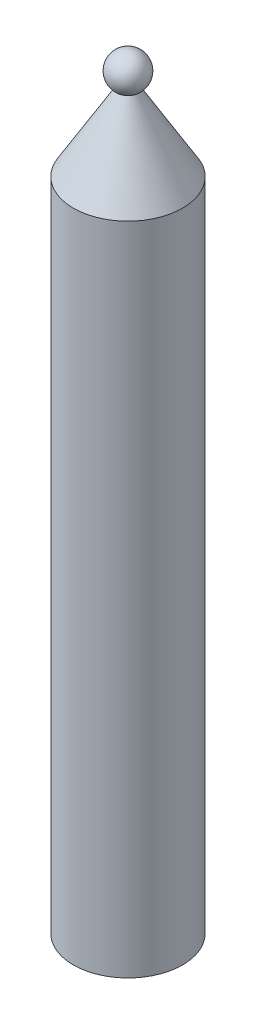
ISO-10303-21;
HEADER;
FILE_DESCRIPTION(('STEP AP214'),'2;1');
FILE_NAME('part.step','',(''),(''),'','','');
FILE_SCHEMA(('AUTOMOTIVE_DESIGN { 1 0 10303 214 1 1 1 1 }'));
ENDSEC;
DATA;
#1=APPLICATION_CONTEXT('core data for automotive mechanical design processes');
#2=APPLICATION_PROTOCOL_DEFINITION('international standard','automotive_design',2000,#1);
#3=PRODUCT_CONTEXT('',#1,'mechanical');
#4=PRODUCT('Part','Part','',(#3));
#5=PRODUCT_RELATED_PRODUCT_CATEGORY('part','',(#4));
#6=PRODUCT_DEFINITION_FORMATION('','',#4);
#7=PRODUCT_DEFINITION_CONTEXT('part definition',#1,'design');
#8=PRODUCT_DEFINITION('design','',#6,#7);
#9=PRODUCT_DEFINITION_SHAPE('','',#8);
#10=(LENGTH_UNIT() NAMED_UNIT(*) SI_UNIT(.MILLI.,.METRE.));
#11=(NAMED_UNIT(*) PLANE_ANGLE_UNIT() SI_UNIT($,.RADIAN.));
#12=(NAMED_UNIT(*) SI_UNIT($,.STERADIAN.) SOLID_ANGLE_UNIT());
#13=UNCERTAINTY_MEASURE_WITH_UNIT(LENGTH_MEASURE(1.E-05),#10,'distance_accuracy_value','');
#14=(GEOMETRIC_REPRESENTATION_CONTEXT(3) GLOBAL_UNCERTAINTY_ASSIGNED_CONTEXT((#13)) GLOBAL_UNIT_ASSIGNED_CONTEXT((#10,
#11,#12)) REPRESENTATION_CONTEXT('',''));
#15=CARTESIAN_POINT('',(0.,0.,0.));
#16=DIRECTION('',(0.,0.,1.));
#17=DIRECTION('',(1.,0.,0.));
#18=AXIS2_PLACEMENT_3D('',#15,#16,#17);
#19=CARTESIAN_POINT('',(0.,0.,0.));
#20=DIRECTION('',(0.,-1.,0.));
#21=DIRECTION('',(0.,0.,-1.));
#22=AXIS2_PLACEMENT_3D('',#19,#20,#21);
#23=PLANE('',#22);
#24=CARTESIAN_POINT('',(0.,0.,0.));
#25=DIRECTION('',(0.,1.,0.));
#26=DIRECTION('',(0.,0.,1.));
#27=AXIS2_PLACEMENT_3D('',#24,#25,#26);
#28=CIRCLE('',#27,5.);
#29=CARTESIAN_POINT('',(0.,0.,5.));
#30=VERTEX_POINT('',#29);
#31=EDGE_CURVE('E62',#30,#30,#28,.T.);
#32=ORIENTED_EDGE('',*,*,#31,.T.);
#33=EDGE_LOOP('',(#32));
#34=FACE_BOUND('',#33,.T.);
#35=CARTESIAN_POINT('',(0.,0.,0.));
#36=DIRECTION('',(0.,1.,0.));
#37=DIRECTION('',(0.,0.,1.));
#38=AXIS2_PLACEMENT_3D('',#35,#36,#37);
#39=CIRCLE('',#38,10.);
#40=CARTESIAN_POINT('',(0.,0.,10.));
#41=VERTEX_POINT('',#40);
#42=EDGE_CURVE('E11',#41,#41,#39,.T.);
#43=ORIENTED_EDGE('',*,*,#42,.F.);
#44=EDGE_LOOP('',(#43));
#45=FACE_BOUND('',#44,.T.);
#46=ADVANCED_FACE('F42',(#34,#45),#23,.T.);
#47=CARTESIAN_POINT('',(0.,140.,0.));
#48=DIRECTION('',(0.,1.,0.));
#49=DIRECTION('',(0.,0.,1.));
#50=AXIS2_PLACEMENT_3D('',#47,#48,#49);
#51=CYLINDRICAL_SURFACE('',#50,10.);
#52=ORIENTED_EDGE('',*,*,#42,.T.);
#53=EDGE_LOOP('',(#52));
#54=FACE_BOUND('',#53,.T.);
#55=CARTESIAN_POINT('',(0.,120.,0.));
#56=DIRECTION('',(0.,1.,0.));
#57=DIRECTION('',(0.,0.,1.));
#58=AXIS2_PLACEMENT_3D('',#55,#56,#57);
#59=CIRCLE('',#58,10.);
#60=CARTESIAN_POINT('',(0.,120.,10.));
#61=VERTEX_POINT('',#60);
#62=EDGE_CURVE('E49',#61,#61,#59,.T.);
#63=ORIENTED_EDGE('',*,*,#62,.F.);
#64=EDGE_LOOP('',(#63));
#65=FACE_BOUND('',#64,.T.);
#66=ADVANCED_FACE('F78',(#54,#65),#51,.T.);
#67=CARTESIAN_POINT('',(0.,134.,0.));
#68=DIRECTION('',(0.,-1.,0.));
#69=DIRECTION('',(0.,0.,-1.));
#70=AXIS2_PLACEMENT_3D('',#67,#68,#69);
#71=CONICAL_SURFACE('',#70,1.6529151545748,0.537635708213951);
#72=ORIENTED_EDGE('',*,*,#62,.T.);
#73=EDGE_LOOP('',(#72));
#74=FACE_BOUND('',#73,.T.);
#75=CARTESIAN_POINT('',(0.,134.,0.));
#76=DIRECTION('',(0.,1.,0.));
#77=DIRECTION('',(0.,0.,1.));
#78=AXIS2_PLACEMENT_3D('',#75,#76,#77);
#79=CIRCLE('',#78,1.6529151545748);
#80=CARTESIAN_POINT('',(0.,134.,1.6529151545748));
#81=VERTEX_POINT('',#80);
#82=EDGE_CURVE('E66',#81,#81,#79,.T.);
#83=ORIENTED_EDGE('',*,*,#82,.F.);
#84=EDGE_LOOP('',(#83));
#85=FACE_BOUND('',#84,.T.);
#86=ADVANCED_FACE('F75',(#74,#85),#71,.T.);
#87=CARTESIAN_POINT('',(0.,136.772322624315,0.));
#88=DIRECTION('',(0.,1.,0.));
#89=DIRECTION('',(-1.,0.,0.));
#90=AXIS2_PLACEMENT_3D('',#87,#88,#89);
#91=SPHERICAL_SURFACE('',#90,3.22767737568526);
#92=ORIENTED_EDGE('',*,*,#82,.T.);
#93=EDGE_LOOP('',(#92));
#94=FACE_BOUND('',#93,.T.);
#95=ADVANCED_FACE('F85',(#94),#91,.T.);
#96=CARTESIAN_POINT('',(0.,120.,0.));
#97=DIRECTION('',(0.,1.,0.));
#98=DIRECTION('',(0.,0.,1.));
#99=AXIS2_PLACEMENT_3D('',#96,#97,#98);
#100=CYLINDRICAL_SURFACE('',#99,5.);
#101=CARTESIAN_POINT('',(0.,110.,0.));
#102=DIRECTION('',(0.,1.,0.));
#103=DIRECTION('',(0.,0.,1.));
#104=AXIS2_PLACEMENT_3D('',#101,#102,#103);
#105=CIRCLE('',#104,5.);
#106=CARTESIAN_POINT('',(0.,110.,5.));
#107=VERTEX_POINT('',#106);
#108=EDGE_CURVE('E59',#107,#107,#105,.T.);
#109=ORIENTED_EDGE('',*,*,#108,.T.);
#110=EDGE_LOOP('',(#109));
#111=FACE_BOUND('',#110,.T.);
#112=ORIENTED_EDGE('',*,*,#31,.F.);
#113=EDGE_LOOP('',(#112));
#114=FACE_BOUND('',#113,.T.);
#115=ADVANCED_FACE('F55',(#111,#114),#100,.F.);
#116=CARTESIAN_POINT('',(0.,110.,0.));
#117=DIRECTION('',(0.,-1.,0.));
#118=DIRECTION('',(0.,0.,-1.));
#119=AXIS2_PLACEMENT_3D('',#116,#117,#118);
#120=CONICAL_SURFACE('',#119,5.,0.463647609000806);
#121=CARTESIAN_POINT('',(0.,120.,0.));
#122=VERTEX_POINT('',#121);
#123=VERTEX_LOOP('',#122);
#124=FACE_BOUND('',#123,.T.);
#125=ORIENTED_EDGE('',*,*,#108,.F.);
#126=EDGE_LOOP('',(#125));
#127=FACE_BOUND('',#126,.T.);
#128=ADVANCED_FACE('F52',(#124,#127),#120,.F.);
#129=CLOSED_SHELL('',(#46,#66,#86,#95,#115,#128));
#130=MANIFOLD_SOLID_BREP('B2',#129);
#131=ADVANCED_BREP_SHAPE_REPRESENTATION('',(#18,#130),#14);
#132=SHAPE_DEFINITION_REPRESENTATION(#9,#131);
ENDSEC;
END-ISO-10303-21;
